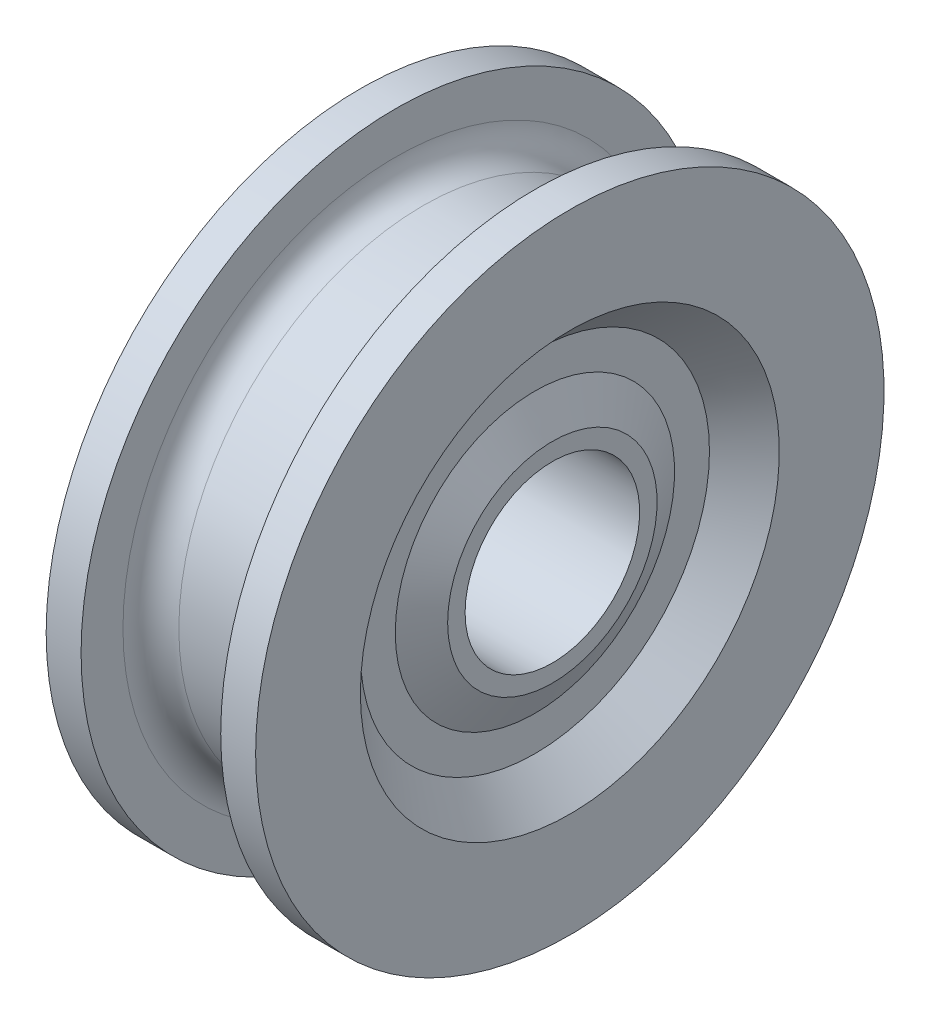
ISO-10303-21;
HEADER;
FILE_DESCRIPTION(('STEP AP214'),'2;1');
FILE_NAME('part.step','',(''),(''),'','','');
FILE_SCHEMA(('AUTOMOTIVE_DESIGN { 1 0 10303 214 1 1 1 1 }'));
ENDSEC;
DATA;
#1=APPLICATION_CONTEXT('core data for automotive mechanical design processes');
#2=APPLICATION_PROTOCOL_DEFINITION('international standard','automotive_design',2000,#1);
#3=PRODUCT_CONTEXT('',#1,'mechanical');
#4=PRODUCT('Part','Part','',(#3));
#5=PRODUCT_RELATED_PRODUCT_CATEGORY('part','',(#4));
#6=PRODUCT_DEFINITION_FORMATION('','',#4);
#7=PRODUCT_DEFINITION_CONTEXT('part definition',#1,'design');
#8=PRODUCT_DEFINITION('design','',#6,#7);
#9=PRODUCT_DEFINITION_SHAPE('','',#8);
#10=(LENGTH_UNIT() NAMED_UNIT(*) SI_UNIT(.MILLI.,.METRE.));
#11=(NAMED_UNIT(*) PLANE_ANGLE_UNIT() SI_UNIT($,.RADIAN.));
#12=(NAMED_UNIT(*) SI_UNIT($,.STERADIAN.) SOLID_ANGLE_UNIT());
#13=UNCERTAINTY_MEASURE_WITH_UNIT(LENGTH_MEASURE(1.E-05),#10,'distance_accuracy_value','');
#14=(GEOMETRIC_REPRESENTATION_CONTEXT(3) GLOBAL_UNCERTAINTY_ASSIGNED_CONTEXT((#13)) GLOBAL_UNIT_ASSIGNED_CONTEXT((#10,
#11,#12)) REPRESENTATION_CONTEXT('',''));
#15=CARTESIAN_POINT('',(0.,0.,0.));
#16=DIRECTION('',(0.,0.,1.));
#17=DIRECTION('',(1.,0.,0.));
#18=AXIS2_PLACEMENT_3D('',#15,#16,#17);
#19=CARTESIAN_POINT('',(1.25,7.5,0.));
#20=DIRECTION('',(1.,0.,0.));
#21=DIRECTION('',(0.,0.,-1.));
#22=AXIS2_PLACEMENT_3D('',#19,#20,#21);
#23=PLANE('',#22);
#24=CARTESIAN_POINT('',(1.25,0.,0.));
#25=DIRECTION('',(-1.,0.,0.));
#26=DIRECTION('',(0.,0.,1.));
#27=AXIS2_PLACEMENT_3D('',#24,#25,#26);
#28=CIRCLE('',#27,6.25);
#29=CARTESIAN_POINT('',(1.25,0.,6.25));
#30=VERTEX_POINT('',#29);
#31=EDGE_CURVE('E91',#30,#30,#28,.T.);
#32=ORIENTED_EDGE('',*,*,#31,.F.);
#33=EDGE_LOOP('',(#32));
#34=FACE_BOUND('',#33,.T.);
#35=CARTESIAN_POINT('',(1.25,0.,0.));
#36=DIRECTION('',(-1.,0.,0.));
#37=DIRECTION('',(0.,0.,1.));
#38=AXIS2_PLACEMENT_3D('',#35,#36,#37);
#39=CIRCLE('',#38,7.5);
#40=CARTESIAN_POINT('',(1.25,0.,7.5));
#41=VERTEX_POINT('',#40);
#42=EDGE_CURVE('E10',#41,#41,#39,.T.);
#43=ORIENTED_EDGE('',*,*,#42,.T.);
#44=EDGE_LOOP('',(#43));
#45=FACE_BOUND('',#44,.T.);
#46=ADVANCED_FACE('F33',(#34,#45),#23,.F.);
#47=CARTESIAN_POINT('',(2.5,0.,0.));
#48=DIRECTION('',(1.,0.,0.));
#49=DIRECTION('',(0.,0.,-1.));
#50=AXIS2_PLACEMENT_3D('',#47,#48,#49);
#51=CONICAL_SURFACE('',#50,10.,1.10714871779409);
#52=ORIENTED_EDGE('',*,*,#42,.F.);
#53=EDGE_LOOP('',(#52));
#54=FACE_BOUND('',#53,.T.);
#55=CARTESIAN_POINT('',(2.5,0.,0.));
#56=DIRECTION('',(-1.,0.,0.));
#57=DIRECTION('',(0.,0.,1.));
#58=AXIS2_PLACEMENT_3D('',#55,#56,#57);
#59=CIRCLE('',#58,10.);
#60=CARTESIAN_POINT('',(2.5,0.,10.));
#61=VERTEX_POINT('',#60);
#62=EDGE_CURVE('E39',#61,#61,#59,.T.);
#63=ORIENTED_EDGE('',*,*,#62,.T.);
#64=EDGE_LOOP('',(#63));
#65=FACE_BOUND('',#64,.T.);
#66=ADVANCED_FACE('F98',(#54,#65),#51,.T.);
#67=CARTESIAN_POINT('',(2.5,12.5,0.));
#68=DIRECTION('',(1.,0.,0.));
#69=DIRECTION('',(0.,0.,-1.));
#70=AXIS2_PLACEMENT_3D('',#67,#68,#69);
#71=PLANE('',#70);
#72=ORIENTED_EDGE('',*,*,#62,.F.);
#73=EDGE_LOOP('',(#72));
#74=FACE_BOUND('',#73,.T.);
#75=CARTESIAN_POINT('',(2.5,0.,0.));
#76=DIRECTION('',(-1.,0.,0.));
#77=DIRECTION('',(0.,0.,1.));
#78=AXIS2_PLACEMENT_3D('',#75,#76,#77);
#79=CIRCLE('',#78,12.5);
#80=CARTESIAN_POINT('',(2.5,0.,12.5));
#81=VERTEX_POINT('',#80);
#82=EDGE_CURVE('E43',#81,#81,#79,.T.);
#83=ORIENTED_EDGE('',*,*,#82,.T.);
#84=EDGE_LOOP('',(#83));
#85=FACE_BOUND('',#84,.T.);
#86=ADVANCED_FACE('F102',(#74,#85),#71,.F.);
#87=CARTESIAN_POINT('',(0.,0.,0.));
#88=DIRECTION('',(-1.,0.,0.));
#89=DIRECTION('',(0.,0.,1.));
#90=AXIS2_PLACEMENT_3D('',#87,#88,#89);
#91=CONICAL_SURFACE('',#90,15.,0.785398163397448);
#92=ORIENTED_EDGE('',*,*,#82,.F.);
#93=EDGE_LOOP('',(#92));
#94=FACE_BOUND('',#93,.T.);
#95=CARTESIAN_POINT('',(0.,0.,0.));
#96=DIRECTION('',(-1.,0.,0.));
#97=DIRECTION('',(0.,0.,1.));
#98=AXIS2_PLACEMENT_3D('',#95,#96,#97);
#99=CIRCLE('',#98,15.);
#100=CARTESIAN_POINT('',(0.,0.,15.));
#101=VERTEX_POINT('',#100);
#102=EDGE_CURVE('E47',#101,#101,#99,.T.);
#103=ORIENTED_EDGE('',*,*,#102,.T.);
#104=EDGE_LOOP('',(#103));
#105=FACE_BOUND('',#104,.T.);
#106=ADVANCED_FACE('F107',(#94,#105),#91,.F.);
#107=CARTESIAN_POINT('',(0.,22.5,0.));
#108=DIRECTION('',(1.,0.,0.));
#109=DIRECTION('',(0.,0.,-1.));
#110=AXIS2_PLACEMENT_3D('',#107,#108,#109);
#111=PLANE('',#110);
#112=ORIENTED_EDGE('',*,*,#102,.F.);
#113=EDGE_LOOP('',(#112));
#114=FACE_BOUND('',#113,.T.);
#115=CARTESIAN_POINT('',(0.,0.,0.));
#116=DIRECTION('',(-1.,0.,0.));
#117=DIRECTION('',(0.,0.,1.));
#118=AXIS2_PLACEMENT_3D('',#115,#116,#117);
#119=CIRCLE('',#118,22.5);
#120=CARTESIAN_POINT('',(0.,0.,22.5));
#121=VERTEX_POINT('',#120);
#122=EDGE_CURVE('E52',#121,#121,#119,.T.);
#123=ORIENTED_EDGE('',*,*,#122,.T.);
#124=EDGE_LOOP('',(#123));
#125=FACE_BOUND('',#124,.T.);
#126=ADVANCED_FACE('F113',(#114,#125),#111,.F.);
#127=CARTESIAN_POINT('',(0.,0.,0.));
#128=DIRECTION('',(-1.,0.,0.));
#129=DIRECTION('',(0.,0.,1.));
#130=AXIS2_PLACEMENT_3D('',#127,#128,#129);
#131=CYLINDRICAL_SURFACE('',#130,22.5);
#132=ORIENTED_EDGE('',*,*,#122,.F.);
#133=EDGE_LOOP('',(#132));
#134=FACE_BOUND('',#133,.T.);
#135=CARTESIAN_POINT('',(2.5,0.,0.));
#136=DIRECTION('',(-1.,0.,0.));
#137=DIRECTION('',(0.,0.,1.));
#138=AXIS2_PLACEMENT_3D('',#135,#136,#137);
#139=CIRCLE('',#138,22.5);
#140=CARTESIAN_POINT('',(2.5,0.,22.5));
#141=VERTEX_POINT('',#140);
#142=EDGE_CURVE('E55',#141,#141,#139,.T.);
#143=ORIENTED_EDGE('',*,*,#142,.T.);
#144=EDGE_LOOP('',(#143));
#145=FACE_BOUND('',#144,.T.);
#146=ADVANCED_FACE('F117',(#134,#145),#131,.T.);
#147=CARTESIAN_POINT('',(2.5,19.5,0.));
#148=DIRECTION('',(-1.,0.,0.));
#149=DIRECTION('',(0.,0.,1.));
#150=AXIS2_PLACEMENT_3D('',#147,#148,#149);
#151=PLANE('',#150);
#152=ORIENTED_EDGE('',*,*,#142,.F.);
#153=EDGE_LOOP('',(#152));
#154=FACE_BOUND('',#153,.T.);
#155=CARTESIAN_POINT('',(2.5,0.,0.));
#156=DIRECTION('',(-1.,0.,0.));
#157=DIRECTION('',(0.,0.,1.));
#158=AXIS2_PLACEMENT_3D('',#155,#156,#157);
#159=CIRCLE('',#158,19.5);
#160=CARTESIAN_POINT('',(2.5,0.,19.5));
#161=VERTEX_POINT('',#160);
#162=EDGE_CURVE('E58',#161,#161,#159,.T.);
#163=ORIENTED_EDGE('',*,*,#162,.T.);
#164=EDGE_LOOP('',(#163));
#165=FACE_BOUND('',#164,.T.);
#166=ADVANCED_FACE('F121',(#154,#165),#151,.F.);
#167=CARTESIAN_POINT('',(4.5,0.,0.));
#168=DIRECTION('',(-1.,0.,0.));
#169=DIRECTION('',(0.,0.,1.));
#170=AXIS2_PLACEMENT_3D('',#167,#168,#169);
#171=TOROIDAL_SURFACE('',#170,19.5,2.);
#172=ORIENTED_EDGE('',*,*,#162,.F.);
#173=EDGE_LOOP('',(#172));
#174=FACE_BOUND('',#173,.T.);
#175=CARTESIAN_POINT('',(4.50000000000001,0.,0.));
#176=DIRECTION('',(-1.,0.,0.));
#177=DIRECTION('',(0.,0.,1.));
#178=AXIS2_PLACEMENT_3D('',#175,#176,#177);
#179=CIRCLE('',#178,17.5);
#180=CARTESIAN_POINT('',(4.50000000000001,0.,17.5));
#181=VERTEX_POINT('',#180);
#182=EDGE_CURVE('E61',#181,#181,#179,.T.);
#183=ORIENTED_EDGE('',*,*,#182,.T.);
#184=EDGE_LOOP('',(#183));
#185=FACE_BOUND('',#184,.T.);
#186=ADVANCED_FACE('F125',(#174,#185),#171,.F.);
#187=CARTESIAN_POINT('',(0.,0.,0.));
#188=DIRECTION('',(-1.,0.,0.));
#189=DIRECTION('',(0.,0.,1.));
#190=AXIS2_PLACEMENT_3D('',#187,#188,#189);
#191=CYLINDRICAL_SURFACE('',#190,17.5);
#192=ORIENTED_EDGE('',*,*,#182,.F.);
#193=EDGE_LOOP('',(#192));
#194=FACE_BOUND('',#193,.T.);
#195=CARTESIAN_POINT('',(10.5,0.,0.));
#196=DIRECTION('',(-1.,0.,0.));
#197=DIRECTION('',(0.,0.,1.));
#198=AXIS2_PLACEMENT_3D('',#195,#196,#197);
#199=CIRCLE('',#198,17.5);
#200=CARTESIAN_POINT('',(10.5,0.,17.5));
#201=VERTEX_POINT('',#200);
#202=EDGE_CURVE('E64',#201,#201,#199,.T.);
#203=ORIENTED_EDGE('',*,*,#202,.T.);
#204=EDGE_LOOP('',(#203));
#205=FACE_BOUND('',#204,.T.);
#206=ADVANCED_FACE('F129',(#194,#205),#191,.T.);
#207=CARTESIAN_POINT('',(10.5,0.,0.));
#208=DIRECTION('',(-1.,0.,0.));
#209=DIRECTION('',(0.,0.,1.));
#210=AXIS2_PLACEMENT_3D('',#207,#208,#209);
#211=TOROIDAL_SURFACE('',#210,19.5,2.);
#212=ORIENTED_EDGE('',*,*,#202,.F.);
#213=EDGE_LOOP('',(#212));
#214=FACE_BOUND('',#213,.T.);
#215=CARTESIAN_POINT('',(12.5,0.,0.));
#216=DIRECTION('',(-1.,0.,0.));
#217=DIRECTION('',(0.,0.,1.));
#218=AXIS2_PLACEMENT_3D('',#215,#216,#217);
#219=CIRCLE('',#218,19.5);
#220=CARTESIAN_POINT('',(12.5,0.,19.5));
#221=VERTEX_POINT('',#220);
#222=EDGE_CURVE('E67',#221,#221,#219,.T.);
#223=ORIENTED_EDGE('',*,*,#222,.T.);
#224=EDGE_LOOP('',(#223));
#225=FACE_BOUND('',#224,.T.);
#226=ADVANCED_FACE('F133',(#214,#225),#211,.F.);
#227=CARTESIAN_POINT('',(12.5,22.5,0.));
#228=DIRECTION('',(1.,0.,0.));
#229=DIRECTION('',(0.,0.,-1.));
#230=AXIS2_PLACEMENT_3D('',#227,#228,#229);
#231=PLANE('',#230);
#232=ORIENTED_EDGE('',*,*,#222,.F.);
#233=EDGE_LOOP('',(#232));
#234=FACE_BOUND('',#233,.T.);
#235=CARTESIAN_POINT('',(12.5,0.,0.));
#236=DIRECTION('',(-1.,0.,0.));
#237=DIRECTION('',(0.,0.,1.));
#238=AXIS2_PLACEMENT_3D('',#235,#236,#237);
#239=CIRCLE('',#238,22.5);
#240=CARTESIAN_POINT('',(12.5,0.,22.5));
#241=VERTEX_POINT('',#240);
#242=EDGE_CURVE('E70',#241,#241,#239,.T.);
#243=ORIENTED_EDGE('',*,*,#242,.T.);
#244=EDGE_LOOP('',(#243));
#245=FACE_BOUND('',#244,.T.);
#246=ADVANCED_FACE('F137',(#234,#245),#231,.F.);
#247=CARTESIAN_POINT('',(0.,0.,0.));
#248=DIRECTION('',(-1.,0.,0.));
#249=DIRECTION('',(0.,0.,1.));
#250=AXIS2_PLACEMENT_3D('',#247,#248,#249);
#251=CYLINDRICAL_SURFACE('',#250,22.5);
#252=ORIENTED_EDGE('',*,*,#242,.F.);
#253=EDGE_LOOP('',(#252));
#254=FACE_BOUND('',#253,.T.);
#255=CARTESIAN_POINT('',(15.,0.,0.));
#256=DIRECTION('',(-1.,0.,0.));
#257=DIRECTION('',(0.,0.,1.));
#258=AXIS2_PLACEMENT_3D('',#255,#256,#257);
#259=CIRCLE('',#258,22.5);
#260=CARTESIAN_POINT('',(15.,0.,22.5));
#261=VERTEX_POINT('',#260);
#262=EDGE_CURVE('E73',#261,#261,#259,.T.);
#263=ORIENTED_EDGE('',*,*,#262,.T.);
#264=EDGE_LOOP('',(#263));
#265=FACE_BOUND('',#264,.T.);
#266=ADVANCED_FACE('F141',(#254,#265),#251,.T.);
#267=CARTESIAN_POINT('',(15.,15.,0.));
#268=DIRECTION('',(-1.,0.,0.));
#269=DIRECTION('',(0.,0.,1.));
#270=AXIS2_PLACEMENT_3D('',#267,#268,#269);
#271=PLANE('',#270);
#272=ORIENTED_EDGE('',*,*,#262,.F.);
#273=EDGE_LOOP('',(#272));
#274=FACE_BOUND('',#273,.T.);
#275=CARTESIAN_POINT('',(15.,0.,0.));
#276=DIRECTION('',(-1.,0.,0.));
#277=DIRECTION('',(0.,0.,1.));
#278=AXIS2_PLACEMENT_3D('',#275,#276,#277);
#279=CIRCLE('',#278,15.);
#280=CARTESIAN_POINT('',(15.,0.,15.));
#281=VERTEX_POINT('',#280);
#282=EDGE_CURVE('E76',#281,#281,#279,.T.);
#283=ORIENTED_EDGE('',*,*,#282,.T.);
#284=EDGE_LOOP('',(#283));
#285=FACE_BOUND('',#284,.T.);
#286=ADVANCED_FACE('F145',(#274,#285),#271,.F.);
#287=CARTESIAN_POINT('',(12.5,0.,0.));
#288=DIRECTION('',(1.,0.,0.));
#289=DIRECTION('',(0.,0.,-1.));
#290=AXIS2_PLACEMENT_3D('',#287,#288,#289);
#291=CONICAL_SURFACE('',#290,12.5,0.785398163397448);
#292=ORIENTED_EDGE('',*,*,#282,.F.);
#293=EDGE_LOOP('',(#292));
#294=FACE_BOUND('',#293,.T.);
#295=CARTESIAN_POINT('',(12.5,0.,0.));
#296=DIRECTION('',(-1.,0.,0.));
#297=DIRECTION('',(0.,0.,1.));
#298=AXIS2_PLACEMENT_3D('',#295,#296,#297);
#299=CIRCLE('',#298,12.5);
#300=CARTESIAN_POINT('',(12.5,0.,12.5));
#301=VERTEX_POINT('',#300);
#302=EDGE_CURVE('E79',#301,#301,#299,.T.);
#303=ORIENTED_EDGE('',*,*,#302,.T.);
#304=EDGE_LOOP('',(#303));
#305=FACE_BOUND('',#304,.T.);
#306=ADVANCED_FACE('F149',(#294,#305),#291,.F.);
#307=CARTESIAN_POINT('',(12.5,10.,0.));
#308=DIRECTION('',(-1.,0.,0.));
#309=DIRECTION('',(0.,0.,1.));
#310=AXIS2_PLACEMENT_3D('',#307,#308,#309);
#311=PLANE('',#310);
#312=ORIENTED_EDGE('',*,*,#302,.F.);
#313=EDGE_LOOP('',(#312));
#314=FACE_BOUND('',#313,.T.);
#315=CARTESIAN_POINT('',(12.5,0.,0.));
#316=DIRECTION('',(-1.,0.,0.));
#317=DIRECTION('',(0.,0.,1.));
#318=AXIS2_PLACEMENT_3D('',#315,#316,#317);
#319=CIRCLE('',#318,10.);
#320=CARTESIAN_POINT('',(12.5,0.,10.));
#321=VERTEX_POINT('',#320);
#322=EDGE_CURVE('E82',#321,#321,#319,.T.);
#323=ORIENTED_EDGE('',*,*,#322,.T.);
#324=EDGE_LOOP('',(#323));
#325=FACE_BOUND('',#324,.T.);
#326=ADVANCED_FACE('F153',(#314,#325),#311,.F.);
#327=CARTESIAN_POINT('',(13.75,0.,0.));
#328=DIRECTION('',(-1.,0.,0.));
#329=DIRECTION('',(0.,0.,1.));
#330=AXIS2_PLACEMENT_3D('',#327,#328,#329);
#331=CONICAL_SURFACE('',#330,7.5,1.10714871779409);
#332=ORIENTED_EDGE('',*,*,#322,.F.);
#333=EDGE_LOOP('',(#332));
#334=FACE_BOUND('',#333,.T.);
#335=CARTESIAN_POINT('',(13.75,0.,0.));
#336=DIRECTION('',(-1.,0.,0.));
#337=DIRECTION('',(0.,0.,1.));
#338=AXIS2_PLACEMENT_3D('',#335,#336,#337);
#339=CIRCLE('',#338,7.5);
#340=CARTESIAN_POINT('',(13.75,0.,7.5));
#341=VERTEX_POINT('',#340);
#342=EDGE_CURVE('E85',#341,#341,#339,.T.);
#343=ORIENTED_EDGE('',*,*,#342,.T.);
#344=EDGE_LOOP('',(#343));
#345=FACE_BOUND('',#344,.T.);
#346=ADVANCED_FACE('F157',(#334,#345),#331,.T.);
#347=CARTESIAN_POINT('',(13.75,6.25,0.));
#348=DIRECTION('',(-1.,0.,0.));
#349=DIRECTION('',(0.,0.,1.));
#350=AXIS2_PLACEMENT_3D('',#347,#348,#349);
#351=PLANE('',#350);
#352=ORIENTED_EDGE('',*,*,#342,.F.);
#353=EDGE_LOOP('',(#352));
#354=FACE_BOUND('',#353,.T.);
#355=CARTESIAN_POINT('',(13.75,0.,0.));
#356=DIRECTION('',(-1.,0.,0.));
#357=DIRECTION('',(0.,0.,1.));
#358=AXIS2_PLACEMENT_3D('',#355,#356,#357);
#359=CIRCLE('',#358,6.25);
#360=CARTESIAN_POINT('',(13.75,0.,6.25));
#361=VERTEX_POINT('',#360);
#362=EDGE_CURVE('E88',#361,#361,#359,.T.);
#363=ORIENTED_EDGE('',*,*,#362,.T.);
#364=EDGE_LOOP('',(#363));
#365=FACE_BOUND('',#364,.T.);
#366=ADVANCED_FACE('F161',(#354,#365),#351,.F.);
#367=CARTESIAN_POINT('',(0.,0.,0.));
#368=DIRECTION('',(-1.,0.,0.));
#369=DIRECTION('',(0.,0.,1.));
#370=AXIS2_PLACEMENT_3D('',#367,#368,#369);
#371=CYLINDRICAL_SURFACE('',#370,6.25);
#372=ORIENTED_EDGE('',*,*,#362,.F.);
#373=EDGE_LOOP('',(#372));
#374=FACE_BOUND('',#373,.T.);
#375=ORIENTED_EDGE('',*,*,#31,.T.);
#376=EDGE_LOOP('',(#375));
#377=FACE_BOUND('',#376,.T.);
#378=ADVANCED_FACE('F95',(#374,#377),#371,.F.);
#379=CLOSED_SHELL('',(#46,#66,#86,#106,#126,#146,#166,#186,#206,#226,#246,#266,#286,#306,#326,
#346,#366,#378));
#380=MANIFOLD_SOLID_BREP('B2',#379);
#381=ADVANCED_BREP_SHAPE_REPRESENTATION('',(#18,#380),#14);
#382=SHAPE_DEFINITION_REPRESENTATION(#9,#381);
ENDSEC;
END-ISO-10303-21;
